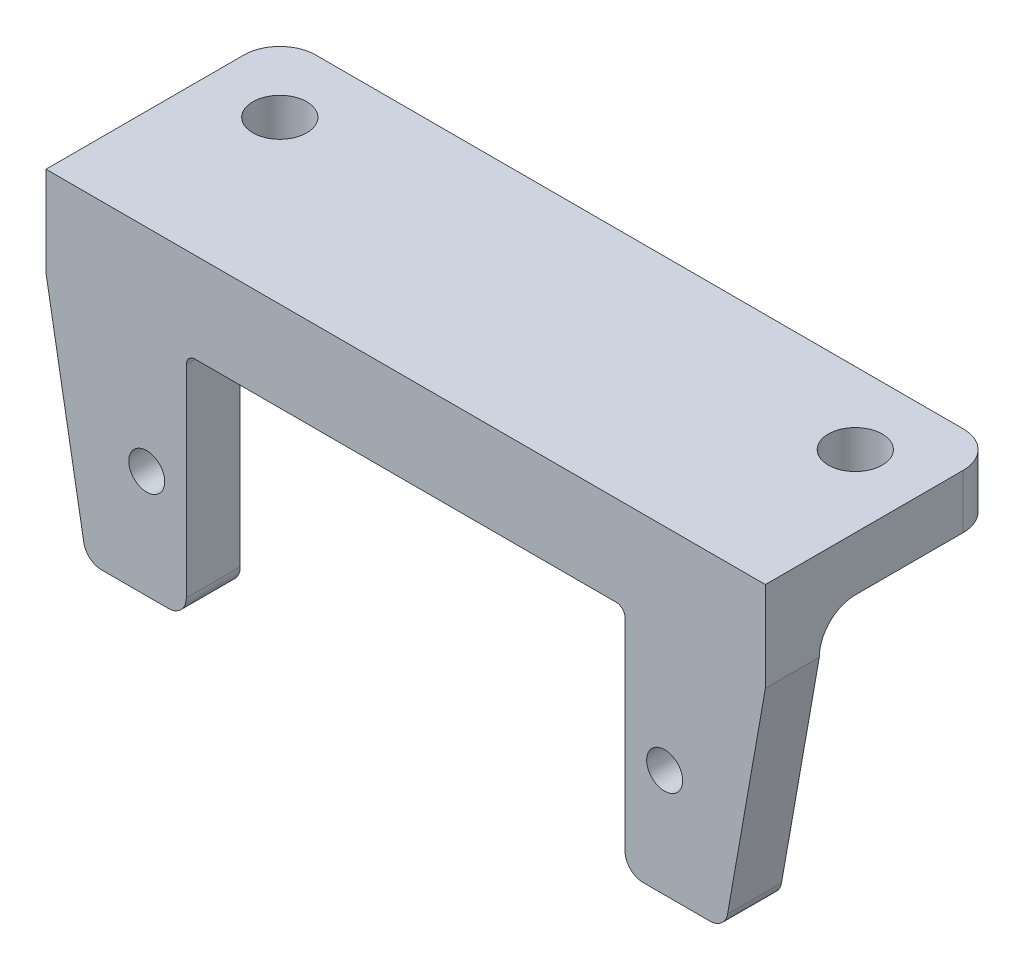
ISO-10303-21;
HEADER;
FILE_DESCRIPTION(('STEP AP214'),'2;1');
FILE_NAME('part.step','',(''),(''),'','','');
FILE_SCHEMA(('AUTOMOTIVE_DESIGN { 1 0 10303 214 1 1 1 1 }'));
ENDSEC;
DATA;
#1=APPLICATION_CONTEXT('core data for automotive mechanical design processes');
#2=APPLICATION_PROTOCOL_DEFINITION('international standard','automotive_design',2000,#1);
#3=PRODUCT_CONTEXT('',#1,'mechanical');
#4=PRODUCT('Part','Part','',(#3));
#5=PRODUCT_RELATED_PRODUCT_CATEGORY('part','',(#4));
#6=PRODUCT_DEFINITION_FORMATION('','',#4);
#7=PRODUCT_DEFINITION_CONTEXT('part definition',#1,'design');
#8=PRODUCT_DEFINITION('design','',#6,#7);
#9=PRODUCT_DEFINITION_SHAPE('','',#8);
#10=(LENGTH_UNIT() NAMED_UNIT(*) SI_UNIT(.MILLI.,.METRE.));
#11=(NAMED_UNIT(*) PLANE_ANGLE_UNIT() SI_UNIT($,.RADIAN.));
#12=(NAMED_UNIT(*) SI_UNIT($,.STERADIAN.) SOLID_ANGLE_UNIT());
#13=UNCERTAINTY_MEASURE_WITH_UNIT(LENGTH_MEASURE(1.E-05),#10,'distance_accuracy_value','');
#14=(GEOMETRIC_REPRESENTATION_CONTEXT(3) GLOBAL_UNCERTAINTY_ASSIGNED_CONTEXT((#13)) GLOBAL_UNIT_ASSIGNED_CONTEXT((#10,
#11,#12)) REPRESENTATION_CONTEXT('',''));
#15=CARTESIAN_POINT('',(0.,0.,0.));
#16=DIRECTION('',(0.,0.,1.));
#17=DIRECTION('',(1.,0.,0.));
#18=AXIS2_PLACEMENT_3D('',#15,#16,#17);
#19=CARTESIAN_POINT('',(20.,8.75,-10.));
#20=DIRECTION('',(0.,1.,0.));
#21=DIRECTION('',(0.,0.,1.));
#22=AXIS2_PLACEMENT_3D('',#19,#20,#21);
#23=PLANE('',#22);
#24=CARTESIAN_POINT('',(-16.,8.75,-6.));
#25=DIRECTION('',(0.,-1.,0.));
#26=DIRECTION('',(0.,0.,-1.));
#27=AXIS2_PLACEMENT_3D('',#24,#25,#26);
#28=CIRCLE('',#27,1.5);
#29=CARTESIAN_POINT('',(-16.,8.75,-7.5));
#30=VERTEX_POINT('',#29);
#31=EDGE_CURVE('E226',#30,#30,#28,.T.);
#32=ORIENTED_EDGE('',*,*,#31,.F.);
#33=EDGE_LOOP('',(#32));
#34=FACE_BOUND('',#33,.T.);
#35=DIRECTION('',(0.,0.,1.));
#36=VECTOR('',#35,1.);
#37=CARTESIAN_POINT('',(-7.5,8.75,-8.));
#38=LINE('',#37,#36);
#39=CARTESIAN_POINT('',(-7.5,8.75,-10.));
#40=VERTEX_POINT('',#39);
#41=CARTESIAN_POINT('',(-7.5,8.75,-2.));
#42=VERTEX_POINT('',#41);
#43=EDGE_CURVE('E204',#40,#42,#38,.T.);
#44=ORIENTED_EDGE('',*,*,#43,.T.);
#45=DIRECTION('',(-1.,0.,0.));
#46=VECTOR('',#45,1.);
#47=CARTESIAN_POINT('',(20.,8.75,-2.));
#48=LINE('',#47,#46);
#49=CARTESIAN_POINT('',(-20.,8.75,-2.));
#50=VERTEX_POINT('',#49);
#51=EDGE_CURVE('E190',#42,#50,#48,.T.);
#52=ORIENTED_EDGE('',*,*,#51,.T.);
#53=DIRECTION('',(0.,0.,1.));
#54=VECTOR('',#53,1.);
#55=CARTESIAN_POINT('',(-20.,8.75,-10.));
#56=LINE('',#55,#54);
#57=CARTESIAN_POINT('',(-20.,8.75,-8.));
#58=VERTEX_POINT('',#57);
#59=EDGE_CURVE('E239',#58,#50,#56,.T.);
#60=ORIENTED_EDGE('',*,*,#59,.F.);
#61=CARTESIAN_POINT('',(-18.,8.75,-8.));
#62=DIRECTION('',(0.,1.,0.));
#63=DIRECTION('',(0.,0.,1.));
#64=AXIS2_PLACEMENT_3D('',#61,#62,#63);
#65=CIRCLE('',#64,2.);
#66=CARTESIAN_POINT('',(-18.,8.75,-10.));
#67=VERTEX_POINT('',#66);
#68=EDGE_CURVE('E42',#58,#67,#65,.F.);
#69=ORIENTED_EDGE('',*,*,#68,.T.);
#70=DIRECTION('',(-1.,0.,0.));
#71=VECTOR('',#70,1.);
#72=CARTESIAN_POINT('',(20.,8.75,-10.));
#73=LINE('',#72,#71);
#74=EDGE_CURVE('E49',#40,#67,#73,.T.);
#75=ORIENTED_EDGE('',*,*,#74,.F.);
#76=EDGE_LOOP('',(#44,#52,#60,#69,#75));
#77=FACE_BOUND('',#76,.T.);
#78=ADVANCED_FACE('F34',(#34,#77),#23,.F.);
#79=CARTESIAN_POINT('',(20.,6.75,-2.));
#80=DIRECTION('',(-1.,0.,0.));
#81=DIRECTION('',(0.,0.,1.));
#82=AXIS2_PLACEMENT_3D('',#79,#80,#81);
#83=CYLINDRICAL_SURFACE('',#82,2.);
#84=CARTESIAN_POINT('',(-7.5,6.75,-2.));
#85=DIRECTION('',(1.,0.,0.));
#86=DIRECTION('',(0.,0.,-1.));
#87=AXIS2_PLACEMENT_3D('',#84,#85,#86);
#88=CIRCLE('',#87,2.);
#89=CARTESIAN_POINT('',(-7.5,6.75,0.));
#90=VERTEX_POINT('',#89);
#91=EDGE_CURVE('E194',#42,#90,#88,.T.);
#92=ORIENTED_EDGE('',*,*,#91,.T.);
#93=DIRECTION('',(1.,0.,0.));
#94=VECTOR('',#93,1.);
#95=CARTESIAN_POINT('',(-11.7,6.75,0.));
#96=LINE('',#95,#94);
#97=CARTESIAN_POINT('',(-11.7,6.75,0.));
#98=VERTEX_POINT('',#97);
#99=EDGE_CURVE('E310',#98,#90,#96,.T.);
#100=ORIENTED_EDGE('',*,*,#99,.F.);
#101=DIRECTION('',(-1.,0.,0.));
#102=VECTOR('',#101,1.);
#103=CARTESIAN_POINT('',(16.9127313647898,6.75,0.));
#104=LINE('',#103,#102);
#105=CARTESIAN_POINT('',(-20.,6.75,0.));
#106=VERTEX_POINT('',#105);
#107=EDGE_CURVE('E367',#106,#98,#104,.F.);
#108=ORIENTED_EDGE('',*,*,#107,.F.);
#109=CARTESIAN_POINT('',(-20.,6.75,-2.));
#110=DIRECTION('',(1.,0.,0.));
#111=DIRECTION('',(0.,0.,-1.));
#112=AXIS2_PLACEMENT_3D('',#109,#110,#111);
#113=CIRCLE('',#112,2.);
#114=EDGE_CURVE('E197',#50,#106,#113,.T.);
#115=ORIENTED_EDGE('',*,*,#114,.F.);
#116=ORIENTED_EDGE('',*,*,#51,.F.);
#117=EDGE_LOOP('',(#92,#100,#108,#115,#116));
#118=FACE_BOUND('',#117,.T.);
#119=ADVANCED_FACE('F191',(#118),#83,.F.);
#120=CARTESIAN_POINT('',(16.9127313647898,-5.,0.));
#121=DIRECTION('',(0.,0.,-1.));
#122=DIRECTION('',(-1.,0.,0.));
#123=AXIS2_PLACEMENT_3D('',#120,#121,#122);
#124=PLANE('',#123);
#125=CARTESIAN_POINT('',(-14.4,0.,0.));
#126=DIRECTION('',(0.,0.,1.));
#127=DIRECTION('',(1.,0.,0.));
#128=AXIS2_PLACEMENT_3D('',#125,#126,#127);
#129=CIRCLE('',#128,1.);
#130=CARTESIAN_POINT('',(-13.4,0.,0.));
#131=VERTEX_POINT('',#130);
#132=EDGE_CURVE('E247',#131,#131,#129,.T.);
#133=ORIENTED_EDGE('',*,*,#132,.T.);
#134=EDGE_LOOP('',(#133));
#135=FACE_BOUND('',#134,.T.);
#136=DIRECTION('',(0.17364817766693,-0.984807753012208,0.));
#137=VECTOR('',#136,1.);
#138=CARTESIAN_POINT('',(-17.897539117802,-5.17364817766693,0.));
#139=LINE('',#138,#137);
#140=CARTESIAN_POINT('',(-17.897539117802,-5.17364817766693,0.));
#141=VERTEX_POINT('',#140);
#142=EDGE_CURVE('E296',#106,#141,#139,.T.);
#143=ORIENTED_EDGE('',*,*,#142,.F.);
#144=ORIENTED_EDGE('',*,*,#107,.T.);
#145=CARTESIAN_POINT('',(-11.7,6.25,0.));
#146=DIRECTION('',(0.,0.,-1.));
#147=DIRECTION('',(1.,0.,0.));
#148=AXIS2_PLACEMENT_3D('',#145,#146,#147);
#149=CIRCLE('',#148,0.5);
#150=CARTESIAN_POINT('',(-12.2,6.25,0.));
#151=VERTEX_POINT('',#150);
#152=EDGE_CURVE('E306',#151,#98,#149,.T.);
#153=ORIENTED_EDGE('',*,*,#152,.F.);
#154=DIRECTION('',(0.,1.,0.));
#155=VECTOR('',#154,1.);
#156=CARTESIAN_POINT('',(-12.2,6.25,0.));
#157=LINE('',#156,#155);
#158=CARTESIAN_POINT('',(-12.2,-5.,0.));
#159=VERTEX_POINT('',#158);
#160=EDGE_CURVE('E304',#159,#151,#157,.T.);
#161=ORIENTED_EDGE('',*,*,#160,.F.);
#162=CARTESIAN_POINT('',(-13.2,-5.,0.));
#163=DIRECTION('',(0.,0.,1.));
#164=DIRECTION('',(-1.,0.,0.));
#165=AXIS2_PLACEMENT_3D('',#162,#163,#164);
#166=CIRCLE('',#165,0.999999999999999);
#167=CARTESIAN_POINT('',(-13.2,-6.,0.));
#168=VERTEX_POINT('',#167);
#169=EDGE_CURVE('E302',#168,#159,#166,.T.);
#170=ORIENTED_EDGE('',*,*,#169,.F.);
#171=DIRECTION('',(1.,0.,0.));
#172=VECTOR('',#171,1.);
#173=CARTESIAN_POINT('',(-13.2,-6.,0.));
#174=LINE('',#173,#172);
#175=CARTESIAN_POINT('',(-16.9127313647898,-6.,0.));
#176=VERTEX_POINT('',#175);
#177=EDGE_CURVE('E300',#176,#168,#174,.T.);
#178=ORIENTED_EDGE('',*,*,#177,.F.);
#179=CARTESIAN_POINT('',(-16.9127313647898,-5.,0.));
#180=DIRECTION('',(0.,0.,1.));
#181=DIRECTION('',(-1.,0.,0.));
#182=AXIS2_PLACEMENT_3D('',#179,#180,#181);
#183=CIRCLE('',#182,1.);
#184=EDGE_CURVE('E298',#141,#176,#183,.T.);
#185=ORIENTED_EDGE('',*,*,#184,.F.);
#186=EDGE_LOOP('',(#143,#144,#153,#161,#170,#178,#185));
#187=FACE_BOUND('',#186,.T.);
#188=ADVANCED_FACE('F433',(#135,#187),#124,.T.);
#189=CARTESIAN_POINT('',(16.9127313647898,-5.,3.));
#190=DIRECTION('',(0.,0.,-1.));
#191=DIRECTION('',(-1.,0.,0.));
#192=AXIS2_PLACEMENT_3D('',#189,#190,#191);
#193=PLANE('',#192);
#194=CARTESIAN_POINT('',(16.9127313647898,-5.,3.));
#195=DIRECTION('',(0.,0.,1.));
#196=DIRECTION('',(-1.,0.,0.));
#197=AXIS2_PLACEMENT_3D('',#194,#195,#196);
#198=CIRCLE('',#197,1.);
#199=CARTESIAN_POINT('',(16.9127313647898,-6.,3.));
#200=VERTEX_POINT('',#199);
#201=CARTESIAN_POINT('',(17.897539117802,-5.17364817766693,3.));
#202=VERTEX_POINT('',#201);
#203=EDGE_CURVE('E256',#200,#202,#198,.T.);
#204=ORIENTED_EDGE('',*,*,#203,.T.);
#205=DIRECTION('',(0.173648177666931,0.984807753012208,0.));
#206=VECTOR('',#205,1.);
#207=CARTESIAN_POINT('',(17.897539117802,-5.17364817766693,3.));
#208=LINE('',#207,#206);
#209=CARTESIAN_POINT('',(20.,6.75,3.));
#210=VERTEX_POINT('',#209);
#211=EDGE_CURVE('E259',#202,#210,#208,.T.);
#212=ORIENTED_EDGE('',*,*,#211,.T.);
#213=DIRECTION('',(0.,1.,0.));
#214=VECTOR('',#213,1.);
#215=CARTESIAN_POINT('',(20.,6.75,3.));
#216=LINE('',#215,#214);
#217=CARTESIAN_POINT('',(20.,11.75,3.));
#218=VERTEX_POINT('',#217);
#219=EDGE_CURVE('E262',#210,#218,#216,.T.);
#220=ORIENTED_EDGE('',*,*,#219,.T.);
#221=DIRECTION('',(-1.,0.,0.));
#222=VECTOR('',#221,1.);
#223=CARTESIAN_POINT('',(-20.,11.75,3.));
#224=LINE('',#223,#222);
#225=CARTESIAN_POINT('',(-20.,11.75,3.));
#226=VERTEX_POINT('',#225);
#227=EDGE_CURVE('E264',#218,#226,#224,.T.);
#228=ORIENTED_EDGE('',*,*,#227,.T.);
#229=DIRECTION('',(0.,-1.,0.));
#230=VECTOR('',#229,1.);
#231=CARTESIAN_POINT('',(-20.,6.75,3.));
#232=LINE('',#231,#230);
#233=CARTESIAN_POINT('',(-20.,6.75,3.));
#234=VERTEX_POINT('',#233);
#235=EDGE_CURVE('E266',#226,#234,#232,.T.);
#236=ORIENTED_EDGE('',*,*,#235,.T.);
#237=DIRECTION('',(0.17364817766693,-0.984807753012208,0.));
#238=VECTOR('',#237,1.);
#239=CARTESIAN_POINT('',(-17.897539117802,-5.17364817766693,3.));
#240=LINE('',#239,#238);
#241=CARTESIAN_POINT('',(-17.897539117802,-5.17364817766693,3.));
#242=VERTEX_POINT('',#241);
#243=EDGE_CURVE('E268',#234,#242,#240,.T.);
#244=ORIENTED_EDGE('',*,*,#243,.T.);
#245=CARTESIAN_POINT('',(-16.9127313647898,-5.,3.));
#246=DIRECTION('',(0.,0.,1.));
#247=DIRECTION('',(-1.,0.,0.));
#248=AXIS2_PLACEMENT_3D('',#245,#246,#247);
#249=CIRCLE('',#248,1.);
#250=CARTESIAN_POINT('',(-16.9127313647898,-6.,3.));
#251=VERTEX_POINT('',#250);
#252=EDGE_CURVE('E270',#242,#251,#249,.T.);
#253=ORIENTED_EDGE('',*,*,#252,.T.);
#254=DIRECTION('',(1.,0.,0.));
#255=VECTOR('',#254,1.);
#256=CARTESIAN_POINT('',(-13.2,-6.,3.));
#257=LINE('',#256,#255);
#258=CARTESIAN_POINT('',(-13.2,-6.,3.));
#259=VERTEX_POINT('',#258);
#260=EDGE_CURVE('E272',#251,#259,#257,.T.);
#261=ORIENTED_EDGE('',*,*,#260,.T.);
#262=CARTESIAN_POINT('',(-13.2,-5.,3.));
#263=DIRECTION('',(0.,0.,1.));
#264=DIRECTION('',(-1.,0.,0.));
#265=AXIS2_PLACEMENT_3D('',#262,#263,#264);
#266=CIRCLE('',#265,0.999999999999999);
#267=CARTESIAN_POINT('',(-12.2,-5.,3.));
#268=VERTEX_POINT('',#267);
#269=EDGE_CURVE('E274',#259,#268,#266,.T.);
#270=ORIENTED_EDGE('',*,*,#269,.T.);
#271=DIRECTION('',(0.,1.,0.));
#272=VECTOR('',#271,1.);
#273=CARTESIAN_POINT('',(-12.2,6.25,3.));
#274=LINE('',#273,#272);
#275=CARTESIAN_POINT('',(-12.2,6.25,3.));
#276=VERTEX_POINT('',#275);
#277=EDGE_CURVE('E276',#268,#276,#274,.T.);
#278=ORIENTED_EDGE('',*,*,#277,.T.);
#279=CARTESIAN_POINT('',(-11.7,6.25,3.));
#280=DIRECTION('',(0.,0.,-1.));
#281=DIRECTION('',(1.,0.,0.));
#282=AXIS2_PLACEMENT_3D('',#279,#280,#281);
#283=CIRCLE('',#282,0.5);
#284=CARTESIAN_POINT('',(-11.7,6.75,3.));
#285=VERTEX_POINT('',#284);
#286=EDGE_CURVE('E278',#276,#285,#283,.T.);
#287=ORIENTED_EDGE('',*,*,#286,.T.);
#288=DIRECTION('',(1.,0.,0.));
#289=VECTOR('',#288,1.);
#290=CARTESIAN_POINT('',(-11.7,6.75,3.));
#291=LINE('',#290,#289);
#292=CARTESIAN_POINT('',(11.7,6.75,3.));
#293=VERTEX_POINT('',#292);
#294=EDGE_CURVE('E280',#285,#293,#291,.T.);
#295=ORIENTED_EDGE('',*,*,#294,.T.);
#296=CARTESIAN_POINT('',(11.7,6.25,3.));
#297=DIRECTION('',(0.,0.,-1.));
#298=DIRECTION('',(1.,0.,0.));
#299=AXIS2_PLACEMENT_3D('',#296,#297,#298);
#300=CIRCLE('',#299,0.5);
#301=CARTESIAN_POINT('',(12.2,6.25,3.));
#302=VERTEX_POINT('',#301);
#303=EDGE_CURVE('E282',#293,#302,#300,.T.);
#304=ORIENTED_EDGE('',*,*,#303,.T.);
#305=DIRECTION('',(0.,-1.,0.));
#306=VECTOR('',#305,1.);
#307=CARTESIAN_POINT('',(12.2,6.25,3.));
#308=LINE('',#307,#306);
#309=CARTESIAN_POINT('',(12.2,-4.99999999999999,3.));
#310=VERTEX_POINT('',#309);
#311=EDGE_CURVE('E284',#302,#310,#308,.T.);
#312=ORIENTED_EDGE('',*,*,#311,.T.);
#313=CARTESIAN_POINT('',(13.2,-5.,3.));
#314=DIRECTION('',(0.,0.,1.));
#315=DIRECTION('',(-1.,0.,0.));
#316=AXIS2_PLACEMENT_3D('',#313,#314,#315);
#317=CIRCLE('',#316,1.);
#318=CARTESIAN_POINT('',(13.2,-6.,3.));
#319=VERTEX_POINT('',#318);
#320=EDGE_CURVE('E286',#310,#319,#317,.T.);
#321=ORIENTED_EDGE('',*,*,#320,.T.);
#322=DIRECTION('',(1.,0.,0.));
#323=VECTOR('',#322,1.);
#324=CARTESIAN_POINT('',(13.2,-6.,3.));
#325=LINE('',#324,#323);
#326=EDGE_CURVE('E288',#319,#200,#325,.T.);
#327=ORIENTED_EDGE('',*,*,#326,.T.);
#328=EDGE_LOOP('',(#204,#212,#220,#228,#236,#244,#253,#261,#270,#278,#287,#295,#304,#312,#321,#327));
#329=FACE_BOUND('',#328,.T.);
#330=CARTESIAN_POINT('',(-14.4,0.,3.));
#331=DIRECTION('',(0.,0.,1.));
#332=DIRECTION('',(1.,0.,0.));
#333=AXIS2_PLACEMENT_3D('',#330,#331,#332);
#334=CIRCLE('',#333,1.);
#335=CARTESIAN_POINT('',(-13.4,0.,3.));
#336=VERTEX_POINT('',#335);
#337=EDGE_CURVE('E250',#336,#336,#334,.T.);
#338=ORIENTED_EDGE('',*,*,#337,.F.);
#339=EDGE_LOOP('',(#338));
#340=FACE_BOUND('',#339,.T.);
#341=CARTESIAN_POINT('',(14.4,0.,3.));
#342=DIRECTION('',(0.,0.,1.));
#343=DIRECTION('',(1.,0.,0.));
#344=AXIS2_PLACEMENT_3D('',#341,#342,#343);
#345=CIRCLE('',#344,1.);
#346=CARTESIAN_POINT('',(15.4,0.,3.));
#347=VERTEX_POINT('',#346);
#348=EDGE_CURVE('E244',#347,#347,#345,.T.);
#349=ORIENTED_EDGE('',*,*,#348,.F.);
#350=EDGE_LOOP('',(#349));
#351=FACE_BOUND('',#350,.T.);
#352=ADVANCED_FACE('F466',(#329,#340,#351),#193,.F.);
#353=CARTESIAN_POINT('',(11.7,6.25,0.));
#354=DIRECTION('',(0.,0.,-1.));
#355=DIRECTION('',(1.,0.,0.));
#356=AXIS2_PLACEMENT_3D('',#353,#354,#355);
#357=CIRCLE('',#356,0.5);
#358=CARTESIAN_POINT('',(11.7,6.75,0.));
#359=VERTEX_POINT('',#358);
#360=CARTESIAN_POINT('',(12.2,6.25,0.));
#361=VERTEX_POINT('',#360);
#362=EDGE_CURVE('E312',#359,#361,#357,.T.);
#363=ORIENTED_EDGE('',*,*,#362,.F.);
#364=DIRECTION('',(-1.,0.,0.));
#365=VECTOR('',#364,1.);
#366=CARTESIAN_POINT('',(16.9127313647898,6.75,0.));
#367=LINE('',#366,#365);
#368=CARTESIAN_POINT('',(20.,6.75,0.));
#369=VERTEX_POINT('',#368);
#370=EDGE_CURVE('E365',#359,#369,#367,.F.);
#371=ORIENTED_EDGE('',*,*,#370,.T.);
#372=DIRECTION('',(0.173648177666931,0.984807753012208,0.));
#373=VECTOR('',#372,1.);
#374=CARTESIAN_POINT('',(17.897539117802,-5.17364817766693,0.));
#375=LINE('',#374,#373);
#376=CARTESIAN_POINT('',(17.897539117802,-5.17364817766693,0.));
#377=VERTEX_POINT('',#376);
#378=EDGE_CURVE('E293',#377,#369,#375,.T.);
#379=ORIENTED_EDGE('',*,*,#378,.F.);
#380=CARTESIAN_POINT('',(16.9127313647898,-5.,0.));
#381=DIRECTION('',(0.,0.,1.));
#382=DIRECTION('',(-1.,0.,0.));
#383=AXIS2_PLACEMENT_3D('',#380,#381,#382);
#384=CIRCLE('',#383,1.);
#385=CARTESIAN_POINT('',(16.9127313647898,-6.,0.));
#386=VERTEX_POINT('',#385);
#387=EDGE_CURVE('E253',#386,#377,#384,.T.);
#388=ORIENTED_EDGE('',*,*,#387,.F.);
#389=DIRECTION('',(1.,0.,0.));
#390=VECTOR('',#389,1.);
#391=CARTESIAN_POINT('',(13.2,-6.,0.));
#392=LINE('',#391,#390);
#393=CARTESIAN_POINT('',(13.2,-6.,0.));
#394=VERTEX_POINT('',#393);
#395=EDGE_CURVE('E260',#394,#386,#392,.T.);
#396=ORIENTED_EDGE('',*,*,#395,.F.);
#397=CARTESIAN_POINT('',(13.2,-5.,0.));
#398=DIRECTION('',(0.,0.,1.));
#399=DIRECTION('',(-1.,0.,0.));
#400=AXIS2_PLACEMENT_3D('',#397,#398,#399);
#401=CIRCLE('',#400,1.);
#402=CARTESIAN_POINT('',(12.2,-4.99999999999999,0.));
#403=VERTEX_POINT('',#402);
#404=EDGE_CURVE('E316',#403,#394,#401,.T.);
#405=ORIENTED_EDGE('',*,*,#404,.F.);
#406=DIRECTION('',(0.,-1.,0.));
#407=VECTOR('',#406,1.);
#408=CARTESIAN_POINT('',(12.2,6.25,0.));
#409=LINE('',#408,#407);
#410=EDGE_CURVE('E314',#361,#403,#409,.T.);
#411=ORIENTED_EDGE('',*,*,#410,.F.);
#412=EDGE_LOOP('',(#363,#371,#379,#388,#396,#405,#411));
#413=FACE_BOUND('',#412,.T.);
#414=CARTESIAN_POINT('',(14.4,0.,0.));
#415=DIRECTION('',(0.,0.,1.));
#416=DIRECTION('',(1.,0.,0.));
#417=AXIS2_PLACEMENT_3D('',#414,#415,#416);
#418=CIRCLE('',#417,1.);
#419=CARTESIAN_POINT('',(15.4,0.,0.));
#420=VERTEX_POINT('',#419);
#421=EDGE_CURVE('E243',#420,#420,#418,.T.);
#422=ORIENTED_EDGE('',*,*,#421,.T.);
#423=EDGE_LOOP('',(#422));
#424=FACE_BOUND('',#423,.T.);
#425=ADVANCED_FACE('F475',(#413,#424),#124,.T.);
#426=CARTESIAN_POINT('',(16.9127313647898,-5.,3.));
#427=DIRECTION('',(0.,0.,-1.));
#428=DIRECTION('',(-1.,0.,0.));
#429=AXIS2_PLACEMENT_3D('',#426,#427,#428);
#430=CYLINDRICAL_SURFACE('',#429,1.);
#431=ORIENTED_EDGE('',*,*,#387,.T.);
#432=DIRECTION('',(0.,0.,-1.));
#433=VECTOR('',#432,1.);
#434=CARTESIAN_POINT('',(17.897539117802,-5.17364817766693,3.));
#435=LINE('',#434,#433);
#436=EDGE_CURVE('E201',#202,#377,#435,.T.);
#437=ORIENTED_EDGE('',*,*,#436,.F.);
#438=ORIENTED_EDGE('',*,*,#203,.F.);
#439=DIRECTION('',(0.,0.,-1.));
#440=VECTOR('',#439,1.);
#441=CARTESIAN_POINT('',(16.9127313647898,-6.,3.));
#442=LINE('',#441,#440);
#443=EDGE_CURVE('E290',#200,#386,#442,.T.);
#444=ORIENTED_EDGE('',*,*,#443,.T.);
#445=EDGE_LOOP('',(#431,#437,#438,#444));
#446=FACE_BOUND('',#445,.T.);
#447=ADVANCED_FACE('F497',(#446),#430,.T.);
#448=CARTESIAN_POINT('',(17.897539117802,-5.17364817766693,3.));
#449=DIRECTION('',(-0.984807753012208,0.173648177666931,0.));
#450=DIRECTION('',(-0.173648177666931,-0.984807753012208,0.));
#451=AXIS2_PLACEMENT_3D('',#448,#449,#450);
#452=PLANE('',#451);
#453=ORIENTED_EDGE('',*,*,#378,.T.);
#454=DIRECTION('',(0.,0.,-1.));
#455=VECTOR('',#454,1.);
#456=CARTESIAN_POINT('',(20.,6.75,3.));
#457=LINE('',#456,#455);
#458=EDGE_CURVE('E360',#210,#369,#457,.T.);
#459=ORIENTED_EDGE('',*,*,#458,.F.);
#460=ORIENTED_EDGE('',*,*,#211,.F.);
#461=ORIENTED_EDGE('',*,*,#436,.T.);
#462=EDGE_LOOP('',(#453,#459,#460,#461));
#463=FACE_BOUND('',#462,.T.);
#464=ADVANCED_FACE('F471',(#463),#452,.F.);
#465=CARTESIAN_POINT('',(20.,6.75,3.));
#466=DIRECTION('',(-1.,0.,0.));
#467=DIRECTION('',(0.,0.,1.));
#468=AXIS2_PLACEMENT_3D('',#465,#466,#467);
#469=PLANE('',#468);
#470=DIRECTION('',(0.,0.,1.));
#471=VECTOR('',#470,1.);
#472=CARTESIAN_POINT('',(20.,8.75,-10.));
#473=LINE('',#472,#471);
#474=CARTESIAN_POINT('',(20.,8.75,-8.));
#475=VERTEX_POINT('',#474);
#476=CARTESIAN_POINT('',(20.,8.75,-2.));
#477=VERTEX_POINT('',#476);
#478=EDGE_CURVE('E241',#475,#477,#473,.T.);
#479=ORIENTED_EDGE('',*,*,#478,.F.);
#480=DIRECTION('',(0.,-1.,0.));
#481=VECTOR('',#480,1.);
#482=CARTESIAN_POINT('',(20.,11.75,-8.));
#483=LINE('',#482,#481);
#484=CARTESIAN_POINT('',(20.,11.75,-8.));
#485=VERTEX_POINT('',#484);
#486=EDGE_CURVE('E11',#475,#485,#483,.F.);
#487=ORIENTED_EDGE('',*,*,#486,.T.);
#488=DIRECTION('',(0.,0.,-1.));
#489=VECTOR('',#488,1.);
#490=CARTESIAN_POINT('',(20.,11.75,3.));
#491=LINE('',#490,#489);
#492=EDGE_CURVE('E357',#218,#485,#491,.T.);
#493=ORIENTED_EDGE('',*,*,#492,.F.);
#494=ORIENTED_EDGE('',*,*,#219,.F.);
#495=ORIENTED_EDGE('',*,*,#458,.T.);
#496=CARTESIAN_POINT('',(20.,6.75,-2.));
#497=DIRECTION('',(-1.,0.,0.));
#498=DIRECTION('',(0.,0.,1.));
#499=AXIS2_PLACEMENT_3D('',#496,#497,#498);
#500=CIRCLE('',#499,2.);
#501=EDGE_CURVE('E370',#369,#477,#500,.T.);
#502=ORIENTED_EDGE('',*,*,#501,.T.);
#503=EDGE_LOOP('',(#479,#487,#493,#494,#495,#502));
#504=FACE_BOUND('',#503,.T.);
#505=ADVANCED_FACE('F407',(#504),#469,.F.);
#506=CARTESIAN_POINT('',(-20.,11.75,3.));
#507=DIRECTION('',(0.,-1.,0.));
#508=DIRECTION('',(0.,0.,-1.));
#509=AXIS2_PLACEMENT_3D('',#506,#507,#508);
#510=PLANE('',#509);
#511=CARTESIAN_POINT('',(16.,11.75,-6.));
#512=DIRECTION('',(0.,1.,0.));
#513=DIRECTION('',(0.,0.,-1.));
#514=AXIS2_PLACEMENT_3D('',#511,#512,#513);
#515=CIRCLE('',#514,1.5);
#516=CARTESIAN_POINT('',(16.,11.75,-7.5));
#517=VERTEX_POINT('',#516);
#518=EDGE_CURVE('E223',#517,#517,#515,.T.);
#519=ORIENTED_EDGE('',*,*,#518,.F.);
#520=EDGE_LOOP('',(#519));
#521=FACE_BOUND('',#520,.T.);
#522=CARTESIAN_POINT('',(-16.,11.75,-6.));
#523=DIRECTION('',(0.,-1.,0.));
#524=DIRECTION('',(0.,0.,-1.));
#525=AXIS2_PLACEMENT_3D('',#522,#523,#524);
#526=CIRCLE('',#525,1.5);
#527=CARTESIAN_POINT('',(-16.,11.75,-7.5));
#528=VERTEX_POINT('',#527);
#529=EDGE_CURVE('E229',#528,#528,#526,.T.);
#530=ORIENTED_EDGE('',*,*,#529,.T.);
#531=EDGE_LOOP('',(#530));
#532=FACE_BOUND('',#531,.T.);
#533=DIRECTION('',(1.,0.,0.));
#534=VECTOR('',#533,1.);
#535=CARTESIAN_POINT('',(20.,11.75,-10.));
#536=LINE('',#535,#534);
#537=CARTESIAN_POINT('',(-18.,11.75,-10.));
#538=VERTEX_POINT('',#537);
#539=CARTESIAN_POINT('',(18.,11.75,-10.));
#540=VERTEX_POINT('',#539);
#541=EDGE_CURVE('E236',#538,#540,#536,.T.);
#542=ORIENTED_EDGE('',*,*,#541,.F.);
#543=CARTESIAN_POINT('',(-18.,11.75,-8.));
#544=DIRECTION('',(0.,-1.,0.));
#545=DIRECTION('',(0.,0.,-1.));
#546=AXIS2_PLACEMENT_3D('',#543,#544,#545);
#547=CIRCLE('',#546,2.);
#548=CARTESIAN_POINT('',(-20.,11.75,-8.));
#549=VERTEX_POINT('',#548);
#550=EDGE_CURVE('E381',#538,#549,#547,.F.);
#551=ORIENTED_EDGE('',*,*,#550,.T.);
#552=DIRECTION('',(0.,0.,-1.));
#553=VECTOR('',#552,1.);
#554=CARTESIAN_POINT('',(-20.,11.75,3.));
#555=LINE('',#554,#553);
#556=EDGE_CURVE('E354',#226,#549,#555,.T.);
#557=ORIENTED_EDGE('',*,*,#556,.F.);
#558=ORIENTED_EDGE('',*,*,#227,.F.);
#559=ORIENTED_EDGE('',*,*,#492,.T.);
#560=CARTESIAN_POINT('',(18.,11.75,-8.));
#561=DIRECTION('',(0.,-1.,0.));
#562=DIRECTION('',(0.,0.,-1.));
#563=AXIS2_PLACEMENT_3D('',#560,#561,#562);
#564=CIRCLE('',#563,2.);
#565=EDGE_CURVE('E379',#485,#540,#564,.F.);
#566=ORIENTED_EDGE('',*,*,#565,.T.);
#567=EDGE_LOOP('',(#542,#551,#557,#558,#559,#566));
#568=FACE_BOUND('',#567,.T.);
#569=ADVANCED_FACE('F396',(#521,#532,#568),#510,.F.);
#570=CARTESIAN_POINT('',(-20.,6.75,3.));
#571=DIRECTION('',(1.,0.,0.));
#572=DIRECTION('',(0.,0.,-1.));
#573=AXIS2_PLACEMENT_3D('',#570,#571,#572);
#574=PLANE('',#573);
#575=ORIENTED_EDGE('',*,*,#556,.T.);
#576=DIRECTION('',(0.,1.,0.));
#577=VECTOR('',#576,1.);
#578=CARTESIAN_POINT('',(-20.,8.75,-8.));
#579=LINE('',#578,#577);
#580=EDGE_CURVE('E383',#549,#58,#579,.F.);
#581=ORIENTED_EDGE('',*,*,#580,.T.);
#582=ORIENTED_EDGE('',*,*,#59,.T.);
#583=ORIENTED_EDGE('',*,*,#114,.T.);
#584=DIRECTION('',(0.,0.,-1.));
#585=VECTOR('',#584,1.);
#586=CARTESIAN_POINT('',(-20.,6.75,3.));
#587=LINE('',#586,#585);
#588=EDGE_CURVE('E351',#234,#106,#587,.T.);
#589=ORIENTED_EDGE('',*,*,#588,.F.);
#590=ORIENTED_EDGE('',*,*,#235,.F.);
#591=EDGE_LOOP('',(#575,#581,#582,#583,#589,#590));
#592=FACE_BOUND('',#591,.T.);
#593=ADVANCED_FACE('F464',(#592),#574,.F.);
#594=CARTESIAN_POINT('',(-17.897539117802,-5.17364817766693,3.));
#595=DIRECTION('',(0.984807753012208,0.17364817766693,0.));
#596=DIRECTION('',(-0.17364817766693,0.984807753012208,0.));
#597=AXIS2_PLACEMENT_3D('',#594,#595,#596);
#598=PLANE('',#597);
#599=ORIENTED_EDGE('',*,*,#142,.T.);
#600=DIRECTION('',(0.,0.,-1.));
#601=VECTOR('',#600,1.);
#602=CARTESIAN_POINT('',(-17.897539117802,-5.17364817766693,3.));
#603=LINE('',#602,#601);
#604=EDGE_CURVE('E348',#242,#141,#603,.T.);
#605=ORIENTED_EDGE('',*,*,#604,.F.);
#606=ORIENTED_EDGE('',*,*,#243,.F.);
#607=ORIENTED_EDGE('',*,*,#588,.T.);
#608=EDGE_LOOP('',(#599,#605,#606,#607));
#609=FACE_BOUND('',#608,.T.);
#610=ADVANCED_FACE('F460',(#609),#598,.F.);
#611=CARTESIAN_POINT('',(-16.9127313647898,-5.,3.));
#612=DIRECTION('',(0.,0.,-1.));
#613=DIRECTION('',(-1.,0.,0.));
#614=AXIS2_PLACEMENT_3D('',#611,#612,#613);
#615=CYLINDRICAL_SURFACE('',#614,1.);
#616=ORIENTED_EDGE('',*,*,#184,.T.);
#617=DIRECTION('',(0.,0.,-1.));
#618=VECTOR('',#617,1.);
#619=CARTESIAN_POINT('',(-16.9127313647898,-6.,3.));
#620=LINE('',#619,#618);
#621=EDGE_CURVE('E345',#251,#176,#620,.T.);
#622=ORIENTED_EDGE('',*,*,#621,.F.);
#623=ORIENTED_EDGE('',*,*,#252,.F.);
#624=ORIENTED_EDGE('',*,*,#604,.T.);
#625=EDGE_LOOP('',(#616,#622,#623,#624));
#626=FACE_BOUND('',#625,.T.);
#627=ADVANCED_FACE('F456',(#626),#615,.T.);
#628=CARTESIAN_POINT('',(-13.2,-6.,3.));
#629=DIRECTION('',(0.,1.,0.));
#630=DIRECTION('',(0.,0.,1.));
#631=AXIS2_PLACEMENT_3D('',#628,#629,#630);
#632=PLANE('',#631);
#633=ORIENTED_EDGE('',*,*,#177,.T.);
#634=DIRECTION('',(0.,0.,-1.));
#635=VECTOR('',#634,1.);
#636=CARTESIAN_POINT('',(-13.2,-6.,3.));
#637=LINE('',#636,#635);
#638=EDGE_CURVE('E342',#259,#168,#637,.T.);
#639=ORIENTED_EDGE('',*,*,#638,.F.);
#640=ORIENTED_EDGE('',*,*,#260,.F.);
#641=ORIENTED_EDGE('',*,*,#621,.T.);
#642=EDGE_LOOP('',(#633,#639,#640,#641));
#643=FACE_BOUND('',#642,.T.);
#644=ADVANCED_FACE('F452',(#643),#632,.F.);
#645=CARTESIAN_POINT('',(-13.2,-5.,3.));
#646=DIRECTION('',(0.,0.,-1.));
#647=DIRECTION('',(-1.,0.,0.));
#648=AXIS2_PLACEMENT_3D('',#645,#646,#647);
#649=CYLINDRICAL_SURFACE('',#648,0.999999999999999);
#650=ORIENTED_EDGE('',*,*,#169,.T.);
#651=DIRECTION('',(0.,0.,-1.));
#652=VECTOR('',#651,1.);
#653=CARTESIAN_POINT('',(-12.2,-5.,3.));
#654=LINE('',#653,#652);
#655=EDGE_CURVE('E339',#268,#159,#654,.T.);
#656=ORIENTED_EDGE('',*,*,#655,.F.);
#657=ORIENTED_EDGE('',*,*,#269,.F.);
#658=ORIENTED_EDGE('',*,*,#638,.T.);
#659=EDGE_LOOP('',(#650,#656,#657,#658));
#660=FACE_BOUND('',#659,.T.);
#661=ADVANCED_FACE('F447',(#660),#649,.T.);
#662=CARTESIAN_POINT('',(-12.2,6.25,3.));
#663=DIRECTION('',(-1.,0.,0.));
#664=DIRECTION('',(0.,-1.,0.));
#665=AXIS2_PLACEMENT_3D('',#662,#663,#664);
#666=PLANE('',#665);
#667=ORIENTED_EDGE('',*,*,#160,.T.);
#668=DIRECTION('',(0.,0.,-1.));
#669=VECTOR('',#668,1.);
#670=CARTESIAN_POINT('',(-12.2,6.25,3.));
#671=LINE('',#670,#669);
#672=EDGE_CURVE('E336',#276,#151,#671,.T.);
#673=ORIENTED_EDGE('',*,*,#672,.F.);
#674=ORIENTED_EDGE('',*,*,#277,.F.);
#675=ORIENTED_EDGE('',*,*,#655,.T.);
#676=EDGE_LOOP('',(#667,#673,#674,#675));
#677=FACE_BOUND('',#676,.T.);
#678=ADVANCED_FACE('F442',(#677),#666,.F.);
#679=CARTESIAN_POINT('',(-11.7,6.25,3.));
#680=DIRECTION('',(0.,0.,-1.));
#681=DIRECTION('',(-1.,0.,0.));
#682=AXIS2_PLACEMENT_3D('',#679,#680,#681);
#683=CYLINDRICAL_SURFACE('',#682,0.5);
#684=ORIENTED_EDGE('',*,*,#152,.T.);
#685=DIRECTION('',(0.,0.,-1.));
#686=VECTOR('',#685,1.);
#687=CARTESIAN_POINT('',(-11.7,6.75,3.));
#688=LINE('',#687,#686);
#689=EDGE_CURVE('E333',#285,#98,#688,.T.);
#690=ORIENTED_EDGE('',*,*,#689,.F.);
#691=ORIENTED_EDGE('',*,*,#286,.F.);
#692=ORIENTED_EDGE('',*,*,#672,.T.);
#693=EDGE_LOOP('',(#684,#690,#691,#692));
#694=FACE_BOUND('',#693,.T.);
#695=ADVANCED_FACE('F437',(#694),#683,.F.);
#696=CARTESIAN_POINT('',(-11.7,6.75,3.));
#697=DIRECTION('',(0.,1.,0.));
#698=DIRECTION('',(0.,0.,1.));
#699=AXIS2_PLACEMENT_3D('',#696,#697,#698);
#700=PLANE('',#699);
#701=ORIENTED_EDGE('',*,*,#99,.T.);
#702=DIRECTION('',(-1.,0.,0.));
#703=VECTOR('',#702,1.);
#704=CARTESIAN_POINT('',(7.5,6.75,0.));
#705=LINE('',#704,#703);
#706=CARTESIAN_POINT('',(7.5,6.75,0.));
#707=VERTEX_POINT('',#706);
#708=EDGE_CURVE('E220',#707,#90,#705,.T.);
#709=ORIENTED_EDGE('',*,*,#708,.F.);
#710=EDGE_CURVE('E309',#707,#359,#96,.T.);
#711=ORIENTED_EDGE('',*,*,#710,.T.);
#712=DIRECTION('',(0.,0.,-1.));
#713=VECTOR('',#712,1.);
#714=CARTESIAN_POINT('',(11.7,6.75,3.));
#715=LINE('',#714,#713);
#716=EDGE_CURVE('E330',#293,#359,#715,.T.);
#717=ORIENTED_EDGE('',*,*,#716,.F.);
#718=ORIENTED_EDGE('',*,*,#294,.F.);
#719=ORIENTED_EDGE('',*,*,#689,.T.);
#720=EDGE_LOOP('',(#701,#709,#711,#717,#718,#719));
#721=FACE_BOUND('',#720,.T.);
#722=ADVANCED_FACE('F426',(#721),#700,.F.);
#723=CARTESIAN_POINT('',(11.7,6.25,3.));
#724=DIRECTION('',(0.,0.,-1.));
#725=DIRECTION('',(-1.,0.,0.));
#726=AXIS2_PLACEMENT_3D('',#723,#724,#725);
#727=CYLINDRICAL_SURFACE('',#726,0.5);
#728=ORIENTED_EDGE('',*,*,#362,.T.);
#729=DIRECTION('',(0.,0.,-1.));
#730=VECTOR('',#729,1.);
#731=CARTESIAN_POINT('',(12.2,6.25,3.));
#732=LINE('',#731,#730);
#733=EDGE_CURVE('E327',#302,#361,#732,.T.);
#734=ORIENTED_EDGE('',*,*,#733,.F.);
#735=ORIENTED_EDGE('',*,*,#303,.F.);
#736=ORIENTED_EDGE('',*,*,#716,.T.);
#737=EDGE_LOOP('',(#728,#734,#735,#736));
#738=FACE_BOUND('',#737,.T.);
#739=ADVANCED_FACE('F482',(#738),#727,.F.);
#740=CARTESIAN_POINT('',(12.2,6.25,3.));
#741=DIRECTION('',(1.,0.,0.));
#742=DIRECTION('',(0.,1.,0.));
#743=AXIS2_PLACEMENT_3D('',#740,#741,#742);
#744=PLANE('',#743);
#745=ORIENTED_EDGE('',*,*,#410,.T.);
#746=DIRECTION('',(0.,0.,-1.));
#747=VECTOR('',#746,1.);
#748=CARTESIAN_POINT('',(12.2,-4.99999999999999,3.));
#749=LINE('',#748,#747);
#750=EDGE_CURVE('E324',#310,#403,#749,.T.);
#751=ORIENTED_EDGE('',*,*,#750,.F.);
#752=ORIENTED_EDGE('',*,*,#311,.F.);
#753=ORIENTED_EDGE('',*,*,#733,.T.);
#754=EDGE_LOOP('',(#745,#751,#752,#753));
#755=FACE_BOUND('',#754,.T.);
#756=ADVANCED_FACE('F486',(#755),#744,.F.);
#757=CARTESIAN_POINT('',(13.2,-5.,3.));
#758=DIRECTION('',(0.,0.,-1.));
#759=DIRECTION('',(-1.,0.,0.));
#760=AXIS2_PLACEMENT_3D('',#757,#758,#759);
#761=CYLINDRICAL_SURFACE('',#760,1.);
#762=ORIENTED_EDGE('',*,*,#404,.T.);
#763=DIRECTION('',(0.,0.,-1.));
#764=VECTOR('',#763,1.);
#765=CARTESIAN_POINT('',(13.2,-6.,3.));
#766=LINE('',#765,#764);
#767=EDGE_CURVE('E321',#319,#394,#766,.T.);
#768=ORIENTED_EDGE('',*,*,#767,.F.);
#769=ORIENTED_EDGE('',*,*,#320,.F.);
#770=ORIENTED_EDGE('',*,*,#750,.T.);
#771=EDGE_LOOP('',(#762,#768,#769,#770));
#772=FACE_BOUND('',#771,.T.);
#773=ADVANCED_FACE('F493',(#772),#761,.T.);
#774=CARTESIAN_POINT('',(13.2,-6.,3.));
#775=DIRECTION('',(0.,1.,0.));
#776=DIRECTION('',(0.,0.,1.));
#777=AXIS2_PLACEMENT_3D('',#774,#775,#776);
#778=PLANE('',#777);
#779=ORIENTED_EDGE('',*,*,#395,.T.);
#780=ORIENTED_EDGE('',*,*,#443,.F.);
#781=ORIENTED_EDGE('',*,*,#326,.F.);
#782=ORIENTED_EDGE('',*,*,#767,.T.);
#783=EDGE_LOOP('',(#779,#780,#781,#782));
#784=FACE_BOUND('',#783,.T.);
#785=ADVANCED_FACE('F495',(#784),#778,.F.);
#786=CARTESIAN_POINT('',(-14.4,0.,3.));
#787=DIRECTION('',(0.,0.,-1.));
#788=DIRECTION('',(-1.,0.,0.));
#789=AXIS2_PLACEMENT_3D('',#786,#787,#788);
#790=CYLINDRICAL_SURFACE('',#789,1.);
#791=ORIENTED_EDGE('',*,*,#337,.T.);
#792=EDGE_LOOP('',(#791));
#793=FACE_BOUND('',#792,.T.);
#794=ORIENTED_EDGE('',*,*,#132,.F.);
#795=EDGE_LOOP('',(#794));
#796=FACE_BOUND('',#795,.T.);
#797=ADVANCED_FACE('F523',(#793,#796),#790,.F.);
#798=CARTESIAN_POINT('',(14.4,0.,3.));
#799=DIRECTION('',(0.,0.,-1.));
#800=DIRECTION('',(-1.,0.,0.));
#801=AXIS2_PLACEMENT_3D('',#798,#799,#800);
#802=CYLINDRICAL_SURFACE('',#801,1.);
#803=ORIENTED_EDGE('',*,*,#348,.T.);
#804=EDGE_LOOP('',(#803));
#805=FACE_BOUND('',#804,.T.);
#806=ORIENTED_EDGE('',*,*,#421,.F.);
#807=EDGE_LOOP('',(#806));
#808=FACE_BOUND('',#807,.T.);
#809=ADVANCED_FACE('F517',(#805,#808),#802,.F.);
#810=CARTESIAN_POINT('',(16.,8.75,-6.));
#811=DIRECTION('',(0.,1.,0.));
#812=DIRECTION('',(0.,0.,-1.));
#813=AXIS2_PLACEMENT_3D('',#810,#811,#812);
#814=CIRCLE('',#813,1.5);
#815=CARTESIAN_POINT('',(16.,8.75,-7.5));
#816=VERTEX_POINT('',#815);
#817=EDGE_CURVE('E222',#816,#816,#814,.T.);
#818=ORIENTED_EDGE('',*,*,#817,.T.);
#819=EDGE_LOOP('',(#818));
#820=FACE_BOUND('',#819,.T.);
#821=CARTESIAN_POINT('',(7.5,8.75,-2.));
#822=VERTEX_POINT('',#821);
#823=EDGE_CURVE('E200',#477,#822,#48,.T.);
#824=ORIENTED_EDGE('',*,*,#823,.T.);
#825=DIRECTION('',(0.,0.,1.));
#826=VECTOR('',#825,1.);
#827=CARTESIAN_POINT('',(7.5,8.75,-10.));
#828=LINE('',#827,#826);
#829=CARTESIAN_POINT('',(7.5,8.75,-10.));
#830=VERTEX_POINT('',#829);
#831=EDGE_CURVE('E57',#830,#822,#828,.T.);
#832=ORIENTED_EDGE('',*,*,#831,.F.);
#833=CARTESIAN_POINT('',(18.,8.75,-10.));
#834=VERTEX_POINT('',#833);
#835=EDGE_CURVE('E234',#834,#830,#73,.T.);
#836=ORIENTED_EDGE('',*,*,#835,.F.);
#837=CARTESIAN_POINT('',(18.,8.75,-8.));
#838=DIRECTION('',(0.,1.,0.));
#839=DIRECTION('',(0.,0.,1.));
#840=AXIS2_PLACEMENT_3D('',#837,#838,#839);
#841=CIRCLE('',#840,2.);
#842=EDGE_CURVE('E385',#834,#475,#841,.F.);
#843=ORIENTED_EDGE('',*,*,#842,.T.);
#844=ORIENTED_EDGE('',*,*,#478,.T.);
#845=EDGE_LOOP('',(#824,#832,#836,#843,#844));
#846=FACE_BOUND('',#845,.T.);
#847=ADVANCED_FACE('F404',(#820,#846),#23,.F.);
#848=CARTESIAN_POINT('',(0.,0.,-10.));
#849=DIRECTION('',(0.,0.,-1.));
#850=DIRECTION('',(-1.,0.,0.));
#851=AXIS2_PLACEMENT_3D('',#848,#849,#850);
#852=PLANE('',#851);
#853=ORIENTED_EDGE('',*,*,#835,.T.);
#854=DIRECTION('',(-1.,0.,0.));
#855=VECTOR('',#854,1.);
#856=CARTESIAN_POINT('',(7.5,8.75,-10.));
#857=LINE('',#856,#855);
#858=EDGE_CURVE('E218',#830,#40,#857,.T.);
#859=ORIENTED_EDGE('',*,*,#858,.T.);
#860=ORIENTED_EDGE('',*,*,#74,.T.);
#861=DIRECTION('',(0.,1.,0.));
#862=VECTOR('',#861,1.);
#863=CARTESIAN_POINT('',(-18.,11.75,-10.));
#864=LINE('',#863,#862);
#865=EDGE_CURVE('E376',#67,#538,#864,.T.);
#866=ORIENTED_EDGE('',*,*,#865,.T.);
#867=ORIENTED_EDGE('',*,*,#541,.T.);
#868=DIRECTION('',(0.,-1.,0.));
#869=VECTOR('',#868,1.);
#870=CARTESIAN_POINT('',(18.,8.75,-10.));
#871=LINE('',#870,#869);
#872=EDGE_CURVE('E373',#540,#834,#871,.T.);
#873=ORIENTED_EDGE('',*,*,#872,.T.);
#874=EDGE_LOOP('',(#853,#859,#860,#866,#867,#873));
#875=FACE_BOUND('',#874,.T.);
#876=ADVANCED_FACE('F393',(#875),#852,.T.);
#877=ORIENTED_EDGE('',*,*,#710,.F.);
#878=CARTESIAN_POINT('',(7.5,6.75,-2.));
#879=DIRECTION('',(1.,0.,0.));
#880=DIRECTION('',(0.,0.,-1.));
#881=AXIS2_PLACEMENT_3D('',#878,#879,#880);
#882=CIRCLE('',#881,2.);
#883=EDGE_CURVE('E208',#822,#707,#882,.T.);
#884=ORIENTED_EDGE('',*,*,#883,.F.);
#885=ORIENTED_EDGE('',*,*,#823,.F.);
#886=ORIENTED_EDGE('',*,*,#501,.F.);
#887=ORIENTED_EDGE('',*,*,#370,.F.);
#888=EDGE_LOOP('',(#877,#884,#885,#886,#887));
#889=FACE_BOUND('',#888,.T.);
#890=ADVANCED_FACE('F414',(#889),#83,.F.);
#891=CARTESIAN_POINT('',(-18.,0.,-8.));
#892=DIRECTION('',(0.,-1.,0.));
#893=DIRECTION('',(0.,0.,-1.));
#894=AXIS2_PLACEMENT_3D('',#891,#892,#893);
#895=CYLINDRICAL_SURFACE('',#894,2.);
#896=ORIENTED_EDGE('',*,*,#68,.F.);
#897=ORIENTED_EDGE('',*,*,#580,.F.);
#898=ORIENTED_EDGE('',*,*,#550,.F.);
#899=ORIENTED_EDGE('',*,*,#865,.F.);
#900=EDGE_LOOP('',(#896,#897,#898,#899));
#901=FACE_BOUND('',#900,.T.);
#902=ADVANCED_FACE('F390',(#901),#895,.T.);
#903=CARTESIAN_POINT('',(18.,0.,-8.));
#904=DIRECTION('',(0.,1.,0.));
#905=DIRECTION('',(0.,0.,1.));
#906=AXIS2_PLACEMENT_3D('',#903,#904,#905);
#907=CYLINDRICAL_SURFACE('',#906,2.);
#908=ORIENTED_EDGE('',*,*,#565,.F.);
#909=ORIENTED_EDGE('',*,*,#486,.F.);
#910=ORIENTED_EDGE('',*,*,#842,.F.);
#911=ORIENTED_EDGE('',*,*,#872,.F.);
#912=EDGE_LOOP('',(#908,#909,#910,#911));
#913=FACE_BOUND('',#912,.T.);
#914=ADVANCED_FACE('F36',(#913),#907,.T.);
#915=CARTESIAN_POINT('',(-16.,11.75,-6.));
#916=DIRECTION('',(0.,-1.,0.));
#917=DIRECTION('',(0.,0.,-1.));
#918=AXIS2_PLACEMENT_3D('',#915,#916,#917);
#919=CYLINDRICAL_SURFACE('',#918,1.5);
#920=ORIENTED_EDGE('',*,*,#529,.F.);
#921=EDGE_LOOP('',(#920));
#922=FACE_BOUND('',#921,.T.);
#923=ORIENTED_EDGE('',*,*,#31,.T.);
#924=EDGE_LOOP('',(#923));
#925=FACE_BOUND('',#924,.T.);
#926=ADVANCED_FACE('F529',(#922,#925),#919,.F.);
#927=CARTESIAN_POINT('',(16.,11.75,-6.));
#928=DIRECTION('',(0.,-1.,0.));
#929=DIRECTION('',(0.,0.,-1.));
#930=AXIS2_PLACEMENT_3D('',#927,#928,#929);
#931=CYLINDRICAL_SURFACE('',#930,1.5);
#932=ORIENTED_EDGE('',*,*,#518,.T.);
#933=EDGE_LOOP('',(#932));
#934=FACE_BOUND('',#933,.T.);
#935=ORIENTED_EDGE('',*,*,#817,.F.);
#936=EDGE_LOOP('',(#935));
#937=FACE_BOUND('',#936,.T.);
#938=ADVANCED_FACE('F527',(#934,#937),#931,.F.);
#939=CARTESIAN_POINT('',(7.5,6.75,0.));
#940=DIRECTION('',(0.,0.98058067569092,0.196116135138184));
#941=DIRECTION('',(0.,-0.196116135138184,0.98058067569092));
#942=AXIS2_PLACEMENT_3D('',#939,#940,#941);
#943=PLANE('',#942);
#944=DIRECTION('',(0.,0.196116135138184,-0.98058067569092));
#945=VECTOR('',#944,1.);
#946=CARTESIAN_POINT('',(-7.5,6.75,0.));
#947=LINE('',#946,#945);
#948=EDGE_CURVE('E209',#90,#40,#947,.T.);
#949=ORIENTED_EDGE('',*,*,#948,.T.);
#950=ORIENTED_EDGE('',*,*,#858,.F.);
#951=DIRECTION('',(0.,0.196116135138184,-0.98058067569092));
#952=VECTOR('',#951,1.);
#953=CARTESIAN_POINT('',(7.5,6.75,0.));
#954=LINE('',#953,#952);
#955=EDGE_CURVE('E419',#707,#830,#954,.T.);
#956=ORIENTED_EDGE('',*,*,#955,.F.);
#957=ORIENTED_EDGE('',*,*,#708,.T.);
#958=EDGE_LOOP('',(#949,#950,#956,#957));
#959=FACE_BOUND('',#958,.T.);
#960=ADVANCED_FACE('F423',(#959),#943,.F.);
#961=CARTESIAN_POINT('',(7.5,6.75,-2.));
#962=DIRECTION('',(1.,0.,0.));
#963=DIRECTION('',(0.,0.,-1.));
#964=AXIS2_PLACEMENT_3D('',#961,#962,#963);
#965=PLANE('',#964);
#966=ORIENTED_EDGE('',*,*,#883,.T.);
#967=ORIENTED_EDGE('',*,*,#955,.T.);
#968=ORIENTED_EDGE('',*,*,#831,.T.);
#969=EDGE_LOOP('',(#966,#967,#968));
#970=FACE_BOUND('',#969,.T.);
#971=ADVANCED_FACE('F417',(#970),#965,.T.);
#972=CARTESIAN_POINT('',(-7.5,6.75,-2.));
#973=DIRECTION('',(1.,0.,0.));
#974=DIRECTION('',(0.,0.,-1.));
#975=AXIS2_PLACEMENT_3D('',#972,#973,#974);
#976=PLANE('',#975);
#977=ORIENTED_EDGE('',*,*,#91,.F.);
#978=ORIENTED_EDGE('',*,*,#43,.F.);
#979=ORIENTED_EDGE('',*,*,#948,.F.);
#980=EDGE_LOOP('',(#977,#978,#979));
#981=FACE_BOUND('',#980,.T.);
#982=ADVANCED_FACE('F211',(#981),#976,.F.);
#983=CLOSED_SHELL('',(#78,#119,#188,#352,#425,#447,#464,#505,#569,#593,#610,#627,#644,#661,#678,
#695,#722,#739,#756,#773,#785,#797,#809,#847,#876,#890,#902,#914,#926,#938,#960,#971,#982));
#984=MANIFOLD_SOLID_BREP('B2',#983);
#985=ADVANCED_BREP_SHAPE_REPRESENTATION('',(#18,#984),#14);
#986=SHAPE_DEFINITION_REPRESENTATION(#9,#985);
ENDSEC;
END-ISO-10303-21;
